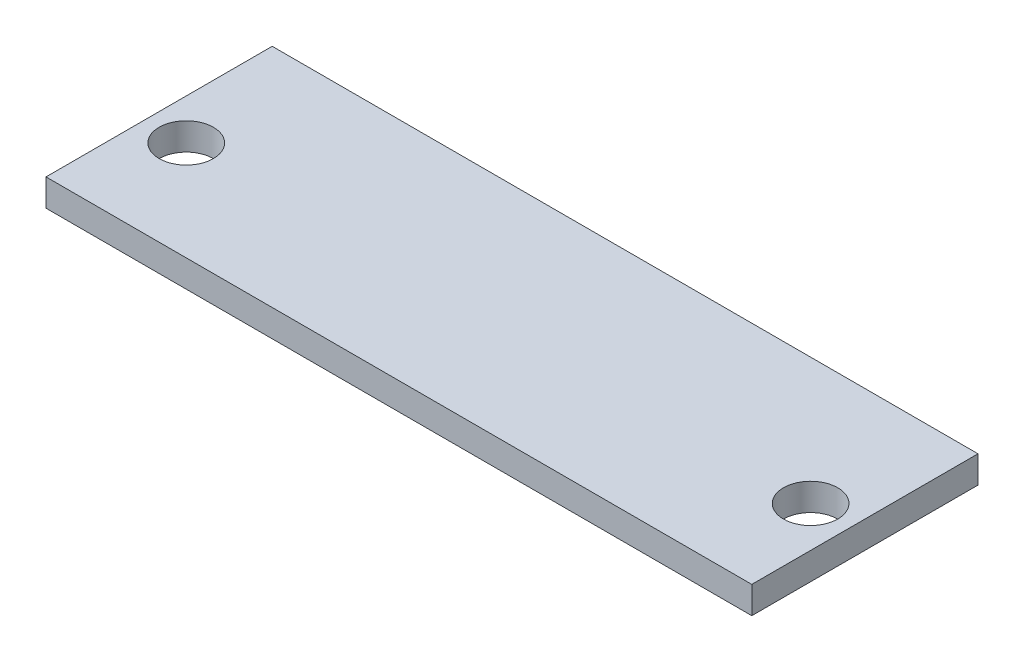
ISO-10303-21;
HEADER;
FILE_DESCRIPTION(('STEP AP214'),'2;1');
FILE_NAME('part.step','',(''),(''),'','','');
FILE_SCHEMA(('AUTOMOTIVE_DESIGN { 1 0 10303 214 1 1 1 1 }'));
ENDSEC;
DATA;
#1=APPLICATION_CONTEXT('core data for automotive mechanical design processes');
#2=APPLICATION_PROTOCOL_DEFINITION('international standard','automotive_design',2000,#1);
#3=PRODUCT_CONTEXT('',#1,'mechanical');
#4=PRODUCT('Part','Part','',(#3));
#5=PRODUCT_RELATED_PRODUCT_CATEGORY('part','',(#4));
#6=PRODUCT_DEFINITION_FORMATION('','',#4);
#7=PRODUCT_DEFINITION_CONTEXT('part definition',#1,'design');
#8=PRODUCT_DEFINITION('design','',#6,#7);
#9=PRODUCT_DEFINITION_SHAPE('','',#8);
#10=(LENGTH_UNIT() NAMED_UNIT(*) SI_UNIT(.MILLI.,.METRE.));
#11=(NAMED_UNIT(*) PLANE_ANGLE_UNIT() SI_UNIT($,.RADIAN.));
#12=(NAMED_UNIT(*) SI_UNIT($,.STERADIAN.) SOLID_ANGLE_UNIT());
#13=UNCERTAINTY_MEASURE_WITH_UNIT(LENGTH_MEASURE(1.E-05),#10,'distance_accuracy_value','');
#14=(GEOMETRIC_REPRESENTATION_CONTEXT(3) GLOBAL_UNCERTAINTY_ASSIGNED_CONTEXT((#13)) GLOBAL_UNIT_ASSIGNED_CONTEXT((#10,
#11,#12)) REPRESENTATION_CONTEXT('',''));
#15=CARTESIAN_POINT('',(0.,0.,0.));
#16=DIRECTION('',(0.,0.,1.));
#17=DIRECTION('',(1.,0.,0.));
#18=AXIS2_PLACEMENT_3D('',#15,#16,#17);
#19=CARTESIAN_POINT('',(0.,3.,0.));
#20=DIRECTION('',(0.,1.,0.));
#21=DIRECTION('',(0.,0.,1.));
#22=AXIS2_PLACEMENT_3D('',#19,#20,#21);
#23=PLANE('',#22);
#24=CARTESIAN_POINT('',(-36.4678920852804,3.,-9.8671875));
#25=DIRECTION('',(0.,1.,0.));
#26=DIRECTION('',(0.,0.,1.));
#27=AXIS2_PLACEMENT_3D('',#24,#25,#26);
#28=CIRCLE('',#27,3.);
#29=CARTESIAN_POINT('',(-36.4678920852804,3.,-6.8671875));
#30=VERTEX_POINT('',#29);
#31=EDGE_CURVE('E108',#30,#30,#28,.T.);
#32=ORIENTED_EDGE('',*,*,#31,.F.);
#33=EDGE_LOOP('',(#32));
#34=FACE_BOUND('',#33,.T.);
#35=DIRECTION('',(0.,0.,1.));
#36=VECTOR('',#35,1.);
#37=CARTESIAN_POINT('',(-40.9678920852804,3.,-23.8671875));
#38=LINE('',#37,#36);
#39=CARTESIAN_POINT('',(-40.9678920852804,3.,-23.8671875));
#40=VERTEX_POINT('',#39);
#41=CARTESIAN_POINT('',(-40.9678920852804,3.,1.1328125));
#42=VERTEX_POINT('',#41);
#43=EDGE_CURVE('E93',#40,#42,#38,.T.);
#44=ORIENTED_EDGE('',*,*,#43,.T.);
#45=DIRECTION('',(1.,0.,0.));
#46=VECTOR('',#45,1.);
#47=CARTESIAN_POINT('',(-40.9678920852804,3.,1.1328125));
#48=LINE('',#47,#46);
#49=CARTESIAN_POINT('',(37.0321079147196,3.,1.1328125));
#50=VERTEX_POINT('',#49);
#51=EDGE_CURVE('E88',#42,#50,#48,.T.);
#52=ORIENTED_EDGE('',*,*,#51,.T.);
#53=DIRECTION('',(0.,0.,-1.));
#54=VECTOR('',#53,1.);
#55=CARTESIAN_POINT('',(37.0321079147196,3.,-23.8671875));
#56=LINE('',#55,#54);
#57=CARTESIAN_POINT('',(37.0321079147196,3.,-23.8671875));
#58=VERTEX_POINT('',#57);
#59=EDGE_CURVE('E91',#50,#58,#56,.T.);
#60=ORIENTED_EDGE('',*,*,#59,.T.);
#61=DIRECTION('',(-1.,0.,0.));
#62=VECTOR('',#61,1.);
#63=CARTESIAN_POINT('',(-40.9678920852804,3.,-23.8671875));
#64=LINE('',#63,#62);
#65=EDGE_CURVE('E58',#58,#40,#64,.T.);
#66=ORIENTED_EDGE('',*,*,#65,.T.);
#67=EDGE_LOOP('',(#44,#52,#60,#66));
#68=FACE_BOUND('',#67,.T.);
#69=CARTESIAN_POINT('',(32.5321079147197,3.,-9.8671875));
#70=DIRECTION('',(0.,1.,0.));
#71=DIRECTION('',(0.,0.,1.));
#72=AXIS2_PLACEMENT_3D('',#69,#70,#71);
#73=CIRCLE('',#72,3.);
#74=CARTESIAN_POINT('',(32.5321079147197,3.,-6.8671875));
#75=VERTEX_POINT('',#74);
#76=EDGE_CURVE('E123',#75,#75,#73,.T.);
#77=ORIENTED_EDGE('',*,*,#76,.F.);
#78=EDGE_LOOP('',(#77));
#79=FACE_BOUND('',#78,.T.);
#80=ADVANCED_FACE('F41',(#34,#68,#79),#23,.T.);
#81=CARTESIAN_POINT('',(0.,0.,0.));
#82=DIRECTION('',(0.,1.,0.));
#83=DIRECTION('',(0.,0.,1.));
#84=AXIS2_PLACEMENT_3D('',#81,#82,#83);
#85=PLANE('',#84);
#86=DIRECTION('',(0.,0.,1.));
#87=VECTOR('',#86,1.);
#88=CARTESIAN_POINT('',(-40.9678920852804,0.,-23.8671875));
#89=LINE('',#88,#87);
#90=CARTESIAN_POINT('',(-40.9678920852804,0.,-23.8671875));
#91=VERTEX_POINT('',#90);
#92=CARTESIAN_POINT('',(-40.9678920852804,0.,1.1328125));
#93=VERTEX_POINT('',#92);
#94=EDGE_CURVE('E105',#91,#93,#89,.T.);
#95=ORIENTED_EDGE('',*,*,#94,.F.);
#96=DIRECTION('',(-1.,0.,0.));
#97=VECTOR('',#96,1.);
#98=CARTESIAN_POINT('',(-40.9678920852804,0.,-23.8671875));
#99=LINE('',#98,#97);
#100=CARTESIAN_POINT('',(37.0321079147196,0.,-23.8671875));
#101=VERTEX_POINT('',#100);
#102=EDGE_CURVE('E81',#101,#91,#99,.T.);
#103=ORIENTED_EDGE('',*,*,#102,.F.);
#104=DIRECTION('',(0.,0.,-1.));
#105=VECTOR('',#104,1.);
#106=CARTESIAN_POINT('',(37.0321079147196,0.,-23.8671875));
#107=LINE('',#106,#105);
#108=CARTESIAN_POINT('',(37.0321079147196,0.,1.1328125));
#109=VERTEX_POINT('',#108);
#110=EDGE_CURVE('E75',#109,#101,#107,.T.);
#111=ORIENTED_EDGE('',*,*,#110,.F.);
#112=DIRECTION('',(1.,0.,0.));
#113=VECTOR('',#112,1.);
#114=CARTESIAN_POINT('',(-40.9678920852804,0.,1.1328125));
#115=LINE('',#114,#113);
#116=EDGE_CURVE('E97',#93,#109,#115,.T.);
#117=ORIENTED_EDGE('',*,*,#116,.F.);
#118=EDGE_LOOP('',(#95,#103,#111,#117));
#119=FACE_BOUND('',#118,.T.);
#120=CARTESIAN_POINT('',(-36.4678920852804,0.,-9.8671875));
#121=DIRECTION('',(0.,1.,0.));
#122=DIRECTION('',(0.,0.,1.));
#123=AXIS2_PLACEMENT_3D('',#120,#121,#122);
#124=CIRCLE('',#123,3.);
#125=CARTESIAN_POINT('',(-36.4678920852804,0.,-6.8671875));
#126=VERTEX_POINT('',#125);
#127=EDGE_CURVE('E120',#126,#126,#124,.T.);
#128=ORIENTED_EDGE('',*,*,#127,.T.);
#129=EDGE_LOOP('',(#128));
#130=FACE_BOUND('',#129,.T.);
#131=CARTESIAN_POINT('',(32.5321079147197,0.,-9.8671875));
#132=DIRECTION('',(0.,1.,0.));
#133=DIRECTION('',(0.,0.,1.));
#134=AXIS2_PLACEMENT_3D('',#131,#132,#133);
#135=CIRCLE('',#134,3.);
#136=CARTESIAN_POINT('',(32.5321079147197,0.,-6.8671875));
#137=VERTEX_POINT('',#136);
#138=EDGE_CURVE('E126',#137,#137,#135,.T.);
#139=ORIENTED_EDGE('',*,*,#138,.T.);
#140=EDGE_LOOP('',(#139));
#141=FACE_BOUND('',#140,.T.);
#142=ADVANCED_FACE('F116',(#119,#130,#141),#85,.F.);
#143=CARTESIAN_POINT('',(-40.9678920852804,3.,-23.8671875));
#144=DIRECTION('',(1.,0.,0.));
#145=DIRECTION('',(0.,0.,-1.));
#146=AXIS2_PLACEMENT_3D('',#143,#144,#145);
#147=PLANE('',#146);
#148=ORIENTED_EDGE('',*,*,#94,.T.);
#149=DIRECTION('',(0.,-1.,0.));
#150=VECTOR('',#149,1.);
#151=CARTESIAN_POINT('',(-40.9678920852804,3.,1.1328125));
#152=LINE('',#151,#150);
#153=EDGE_CURVE('E11',#42,#93,#152,.T.);
#154=ORIENTED_EDGE('',*,*,#153,.F.);
#155=ORIENTED_EDGE('',*,*,#43,.F.);
#156=DIRECTION('',(0.,-1.,0.));
#157=VECTOR('',#156,1.);
#158=CARTESIAN_POINT('',(-40.9678920852804,3.,-23.8671875));
#159=LINE('',#158,#157);
#160=EDGE_CURVE('E101',#40,#91,#159,.T.);
#161=ORIENTED_EDGE('',*,*,#160,.T.);
#162=EDGE_LOOP('',(#148,#154,#155,#161));
#163=FACE_BOUND('',#162,.T.);
#164=ADVANCED_FACE('F43',(#163),#147,.F.);
#165=CARTESIAN_POINT('',(-40.9678920852804,3.,1.1328125));
#166=DIRECTION('',(0.,0.,-1.));
#167=DIRECTION('',(-1.,0.,0.));
#168=AXIS2_PLACEMENT_3D('',#165,#166,#167);
#169=PLANE('',#168);
#170=ORIENTED_EDGE('',*,*,#116,.T.);
#171=DIRECTION('',(0.,-1.,0.));
#172=VECTOR('',#171,1.);
#173=CARTESIAN_POINT('',(37.0321079147196,3.,1.1328125));
#174=LINE('',#173,#172);
#175=EDGE_CURVE('E50',#50,#109,#174,.T.);
#176=ORIENTED_EDGE('',*,*,#175,.F.);
#177=ORIENTED_EDGE('',*,*,#51,.F.);
#178=ORIENTED_EDGE('',*,*,#153,.T.);
#179=EDGE_LOOP('',(#170,#176,#177,#178));
#180=FACE_BOUND('',#179,.T.);
#181=ADVANCED_FACE('F96',(#180),#169,.F.);
#182=CARTESIAN_POINT('',(37.0321079147196,3.,-23.8671875));
#183=DIRECTION('',(-1.,0.,0.));
#184=DIRECTION('',(0.,0.,1.));
#185=AXIS2_PLACEMENT_3D('',#182,#183,#184);
#186=PLANE('',#185);
#187=ORIENTED_EDGE('',*,*,#110,.T.);
#188=DIRECTION('',(0.,-1.,0.));
#189=VECTOR('',#188,1.);
#190=CARTESIAN_POINT('',(37.0321079147196,3.,-23.8671875));
#191=LINE('',#190,#189);
#192=EDGE_CURVE('E98',#58,#101,#191,.T.);
#193=ORIENTED_EDGE('',*,*,#192,.F.);
#194=ORIENTED_EDGE('',*,*,#59,.F.);
#195=ORIENTED_EDGE('',*,*,#175,.T.);
#196=EDGE_LOOP('',(#187,#193,#194,#195));
#197=FACE_BOUND('',#196,.T.);
#198=ADVANCED_FACE('F99',(#197),#186,.F.);
#199=CARTESIAN_POINT('',(-40.9678920852804,3.,-23.8671875));
#200=DIRECTION('',(0.,0.,1.));
#201=DIRECTION('',(1.,0.,0.));
#202=AXIS2_PLACEMENT_3D('',#199,#200,#201);
#203=PLANE('',#202);
#204=ORIENTED_EDGE('',*,*,#102,.T.);
#205=ORIENTED_EDGE('',*,*,#160,.F.);
#206=ORIENTED_EDGE('',*,*,#65,.F.);
#207=ORIENTED_EDGE('',*,*,#192,.T.);
#208=EDGE_LOOP('',(#204,#205,#206,#207));
#209=FACE_BOUND('',#208,.T.);
#210=ADVANCED_FACE('F113',(#209),#203,.F.);
#211=CARTESIAN_POINT('',(-36.4678920852804,3.,-9.8671875));
#212=DIRECTION('',(0.,-1.,0.));
#213=DIRECTION('',(0.,0.,-1.));
#214=AXIS2_PLACEMENT_3D('',#211,#212,#213);
#215=CYLINDRICAL_SURFACE('',#214,3.);
#216=ORIENTED_EDGE('',*,*,#31,.T.);
#217=EDGE_LOOP('',(#216));
#218=FACE_BOUND('',#217,.T.);
#219=ORIENTED_EDGE('',*,*,#127,.F.);
#220=EDGE_LOOP('',(#219));
#221=FACE_BOUND('',#220,.T.);
#222=ADVANCED_FACE('F143',(#218,#221),#215,.F.);
#223=CARTESIAN_POINT('',(32.5321079147197,3.,-9.8671875));
#224=DIRECTION('',(0.,-1.,0.));
#225=DIRECTION('',(0.,0.,-1.));
#226=AXIS2_PLACEMENT_3D('',#223,#224,#225);
#227=CYLINDRICAL_SURFACE('',#226,3.);
#228=ORIENTED_EDGE('',*,*,#76,.T.);
#229=EDGE_LOOP('',(#228));
#230=FACE_BOUND('',#229,.T.);
#231=ORIENTED_EDGE('',*,*,#138,.F.);
#232=EDGE_LOOP('',(#231));
#233=FACE_BOUND('',#232,.T.);
#234=ADVANCED_FACE('F132',(#230,#233),#227,.F.);
#235=CLOSED_SHELL('',(#80,#142,#164,#181,#198,#210,#222,#234));
#236=MANIFOLD_SOLID_BREP('B2',#235);
#237=ADVANCED_BREP_SHAPE_REPRESENTATION('',(#18,#236),#14);
#238=SHAPE_DEFINITION_REPRESENTATION(#9,#237);
ENDSEC;
END-ISO-10303-21;
